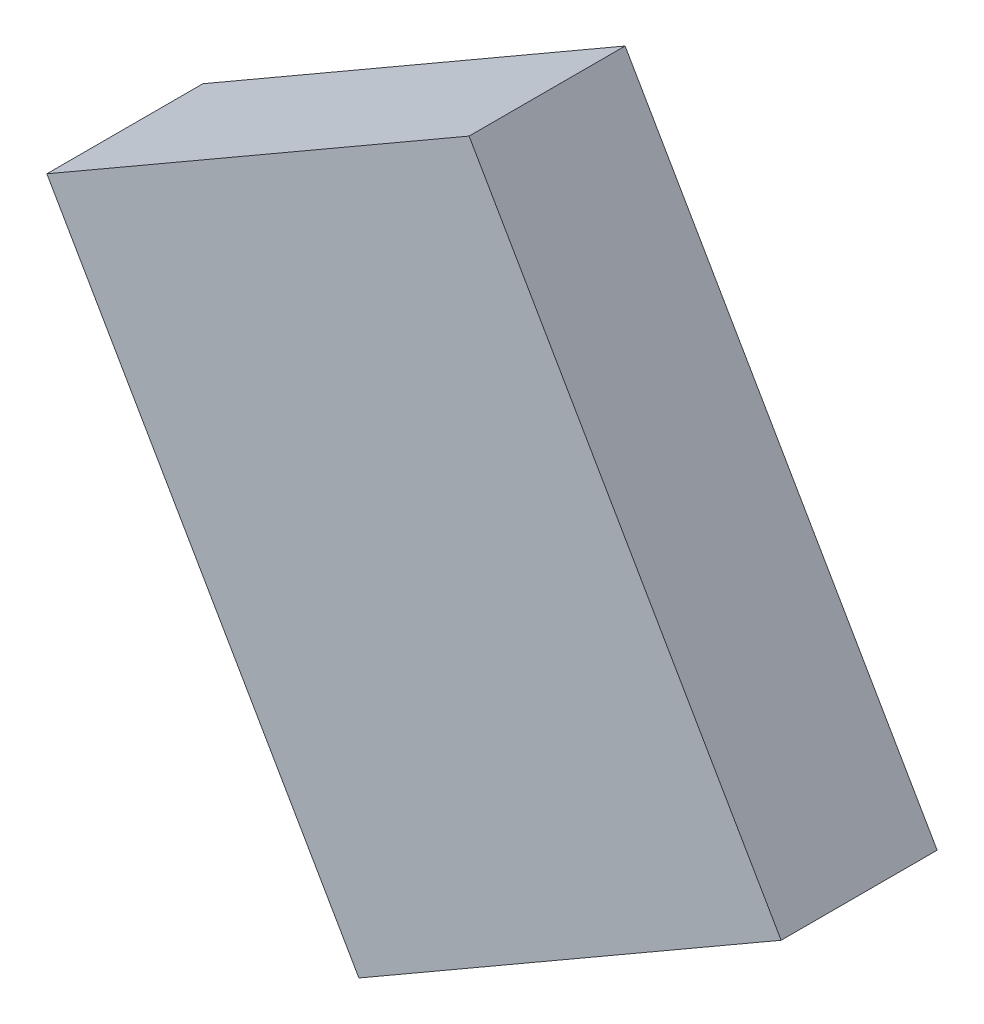
ISO-10303-21;
HEADER;
FILE_DESCRIPTION(('STEP AP214'),'2;1');
FILE_NAME('part.step','',(''),(''),'','','');
FILE_SCHEMA(('AUTOMOTIVE_DESIGN { 1 0 10303 214 1 1 1 1 }'));
ENDSEC;
DATA;
#1=APPLICATION_CONTEXT('core data for automotive mechanical design processes');
#2=APPLICATION_PROTOCOL_DEFINITION('international standard','automotive_design',2000,#1);
#3=PRODUCT_CONTEXT('',#1,'mechanical');
#4=PRODUCT('Part','Part','',(#3));
#5=PRODUCT_RELATED_PRODUCT_CATEGORY('part','',(#4));
#6=PRODUCT_DEFINITION_FORMATION('','',#4);
#7=PRODUCT_DEFINITION_CONTEXT('part definition',#1,'design');
#8=PRODUCT_DEFINITION('design','',#6,#7);
#9=PRODUCT_DEFINITION_SHAPE('','',#8);
#10=(LENGTH_UNIT() NAMED_UNIT(*) SI_UNIT(.MILLI.,.METRE.));
#11=(NAMED_UNIT(*) PLANE_ANGLE_UNIT() SI_UNIT($,.RADIAN.));
#12=(NAMED_UNIT(*) SI_UNIT($,.STERADIAN.) SOLID_ANGLE_UNIT());
#13=UNCERTAINTY_MEASURE_WITH_UNIT(LENGTH_MEASURE(1.E-05),#10,'distance_accuracy_value','');
#14=(GEOMETRIC_REPRESENTATION_CONTEXT(3) GLOBAL_UNCERTAINTY_ASSIGNED_CONTEXT((#13)) GLOBAL_UNIT_ASSIGNED_CONTEXT((#10,
#11,#12)) REPRESENTATION_CONTEXT('',''));
#15=CARTESIAN_POINT('',(0.,0.,0.));
#16=DIRECTION('',(0.,0.,1.));
#17=DIRECTION('',(1.,0.,0.));
#18=AXIS2_PLACEMENT_3D('',#15,#16,#17);
#19=CARTESIAN_POINT('',(-1.88253116,0.7606411,0.80000094));
#20=DIRECTION('',(0.,0.,-1.));
#21=DIRECTION('',(-1.,0.,0.));
#22=AXIS2_PLACEMENT_3D('',#19,#20,#21);
#23=PLANE('',#22);
#24=DIRECTION('',(-0.866024903968885,-0.500000865704934,0.));
#25=VECTOR('',#24,1.);
#26=CARTESIAN_POINT('',(-0.28253182,-2.01064114,0.80000094));
#27=LINE('',#26,#25);
#28=CARTESIAN_POINT('',(-0.282531820000206,-2.01064114000012,0.80000094));
#29=VERTEX_POINT('',#28);
#30=CARTESIAN_POINT('',(1.88253115999996,-0.760638559999925,0.80000094));
#31=VERTEX_POINT('',#30);
#32=EDGE_CURVE('E55',#29,#31,#27,.F.);
#33=ORIENTED_EDGE('',*,*,#32,.T.);
#34=DIRECTION('',(0.500000060750926,-0.866025368709872,0.));
#35=VECTOR('',#34,1.);
#36=CARTESIAN_POINT('',(1.88253116,-0.76063856,0.80000094));
#37=LINE('',#36,#35);
#38=CARTESIAN_POINT('',(0.282531820000269,2.01064114000016,0.80000094));
#39=VERTEX_POINT('',#38);
#40=EDGE_CURVE('E57',#31,#39,#37,.F.);
#41=ORIENTED_EDGE('',*,*,#40,.T.);
#42=DIRECTION('',(0.866025343910241,0.500000103705139,0.));
#43=VECTOR('',#42,1.);
#44=CARTESIAN_POINT('',(0.28253182,2.01064114,0.80000094));
#45=LINE('',#44,#43);
#46=CARTESIAN_POINT('',(-1.88253116000016,0.760641100000285,0.80000094));
#47=VERTEX_POINT('',#46);
#48=EDGE_CURVE('E20',#39,#47,#45,.F.);
#49=ORIENTED_EDGE('',*,*,#48,.T.);
#50=DIRECTION('',(-0.499999717047159,0.866025567147276,0.));
#51=VECTOR('',#50,1.);
#52=CARTESIAN_POINT('',(-1.88253116,0.7606411,0.80000094));
#53=LINE('',#52,#51);
#54=EDGE_CURVE('E80',#47,#29,#53,.F.);
#55=ORIENTED_EDGE('',*,*,#54,.T.);
#56=EDGE_LOOP('',(#33,#41,#49,#55));
#57=FACE_BOUND('',#56,.T.);
#58=ADVANCED_FACE('F17',(#57),#23,.F.);
#59=CARTESIAN_POINT('',(0.28253182,2.01064114,0.));
#60=DIRECTION('',(0.500000103705139,-0.866025343910241,0.));
#61=DIRECTION('',(0.866025343910241,0.500000103705139,0.));
#62=AXIS2_PLACEMENT_3D('',#59,#60,#61);
#63=PLANE('',#62);
#64=DIRECTION('',(0.,0.,1.));
#65=VECTOR('',#64,1.);
#66=CARTESIAN_POINT('',(-1.88253116,0.7606411,0.));
#67=LINE('',#66,#65);
#68=CARTESIAN_POINT('',(-1.88253116000016,0.760641100000285,0.));
#69=VERTEX_POINT('',#68);
#70=EDGE_CURVE('E68',#69,#47,#67,.T.);
#71=ORIENTED_EDGE('',*,*,#70,.T.);
#72=ORIENTED_EDGE('',*,*,#48,.F.);
#73=DIRECTION('',(0.,0.,1.));
#74=VECTOR('',#73,1.);
#75=CARTESIAN_POINT('',(0.282531820001077,2.01064114000062,0.));
#76=LINE('',#75,#74);
#77=CARTESIAN_POINT('',(0.282531820000269,2.01064114000016,0.));
#78=VERTEX_POINT('',#77);
#79=EDGE_CURVE('E63',#39,#78,#76,.F.);
#80=ORIENTED_EDGE('',*,*,#79,.T.);
#81=DIRECTION('',(0.866025343910109,0.500000103705367,0.));
#82=VECTOR('',#81,1.);
#83=CARTESIAN_POINT('',(-1.88253116,0.7606411,0.));
#84=LINE('',#83,#82);
#85=EDGE_CURVE('E83',#69,#78,#84,.T.);
#86=ORIENTED_EDGE('',*,*,#85,.F.);
#87=EDGE_LOOP('',(#71,#72,#80,#86));
#88=FACE_BOUND('',#87,.T.);
#89=ADVANCED_FACE('F65',(#88),#63,.F.);
#90=CARTESIAN_POINT('',(1.88253116,-0.76063856,0.));
#91=DIRECTION('',(-0.866025368709872,-0.500000060750926,0.));
#92=DIRECTION('',(0.500000060750926,-0.866025368709872,0.));
#93=AXIS2_PLACEMENT_3D('',#90,#91,#92);
#94=PLANE('',#93);
#95=ORIENTED_EDGE('',*,*,#79,.F.);
#96=ORIENTED_EDGE('',*,*,#40,.F.);
#97=DIRECTION('',(0.,0.,1.));
#98=VECTOR('',#97,1.);
#99=CARTESIAN_POINT('',(1.88253115999983,-0.760638559999701,0.));
#100=LINE('',#99,#98);
#101=CARTESIAN_POINT('',(1.88253115999996,-0.760638559999925,0.));
#102=VERTEX_POINT('',#101);
#103=EDGE_CURVE('E75',#31,#102,#100,.F.);
#104=ORIENTED_EDGE('',*,*,#103,.T.);
#105=DIRECTION('',(0.500000060751263,-0.866025368709678,0.));
#106=VECTOR('',#105,1.);
#107=CARTESIAN_POINT('',(0.28253182,2.01064114,0.));
#108=LINE('',#107,#106);
#109=EDGE_CURVE('E72',#78,#102,#108,.T.);
#110=ORIENTED_EDGE('',*,*,#109,.F.);
#111=EDGE_LOOP('',(#95,#96,#104,#110));
#112=FACE_BOUND('',#111,.T.);
#113=ADVANCED_FACE('F70',(#112),#94,.F.);
#114=CARTESIAN_POINT('',(-0.28253182,-2.01064114,0.));
#115=DIRECTION('',(-0.500000865704934,0.866024903968885,0.));
#116=DIRECTION('',(-0.866024903968885,-0.500000865704934,0.));
#117=AXIS2_PLACEMENT_3D('',#114,#115,#116);
#118=PLANE('',#117);
#119=ORIENTED_EDGE('',*,*,#103,.F.);
#120=ORIENTED_EDGE('',*,*,#32,.F.);
#121=DIRECTION('',(0.,0.,1.));
#122=VECTOR('',#121,1.);
#123=CARTESIAN_POINT('',(-0.282531820000822,-2.01064114000048,0.));
#124=LINE('',#123,#122);
#125=CARTESIAN_POINT('',(-0.282531820000206,-2.01064114000012,0.));
#126=VERTEX_POINT('',#125);
#127=EDGE_CURVE('E35',#29,#126,#124,.F.);
#128=ORIENTED_EDGE('',*,*,#127,.T.);
#129=DIRECTION('',(-0.866024903968954,-0.500000865704814,0.));
#130=VECTOR('',#129,1.);
#131=CARTESIAN_POINT('',(1.88253116,-0.76063856,0.));
#132=LINE('',#131,#130);
#133=EDGE_CURVE('E26',#102,#126,#132,.T.);
#134=ORIENTED_EDGE('',*,*,#133,.F.);
#135=EDGE_LOOP('',(#119,#120,#128,#134));
#136=FACE_BOUND('',#135,.T.);
#137=ADVANCED_FACE('F89',(#136),#118,.F.);
#138=CARTESIAN_POINT('',(-1.88253116,0.7606411,0.));
#139=DIRECTION('',(0.866025567147276,0.499999717047159,0.));
#140=DIRECTION('',(-0.499999717047159,0.866025567147276,0.));
#141=AXIS2_PLACEMENT_3D('',#138,#139,#140);
#142=PLANE('',#141);
#143=ORIENTED_EDGE('',*,*,#127,.F.);
#144=ORIENTED_EDGE('',*,*,#54,.F.);
#145=ORIENTED_EDGE('',*,*,#70,.F.);
#146=DIRECTION('',(-0.499999717047416,0.866025567147127,0.));
#147=VECTOR('',#146,1.);
#148=CARTESIAN_POINT('',(-0.28253182,-2.01064114,0.));
#149=LINE('',#148,#147);
#150=EDGE_CURVE('E11',#126,#69,#149,.T.);
#151=ORIENTED_EDGE('',*,*,#150,.F.);
#152=EDGE_LOOP('',(#143,#144,#145,#151));
#153=FACE_BOUND('',#152,.T.);
#154=ADVANCED_FACE('F91',(#153),#142,.F.);
#155=CARTESIAN_POINT('',(-1.88253116,0.7606411,0.));
#156=DIRECTION('',(0.,0.,-1.));
#157=DIRECTION('',(-1.,0.,0.));
#158=AXIS2_PLACEMENT_3D('',#155,#156,#157);
#159=PLANE('',#158);
#160=ORIENTED_EDGE('',*,*,#133,.T.);
#161=ORIENTED_EDGE('',*,*,#150,.T.);
#162=ORIENTED_EDGE('',*,*,#85,.T.);
#163=ORIENTED_EDGE('',*,*,#109,.T.);
#164=EDGE_LOOP('',(#160,#161,#162,#163));
#165=FACE_BOUND('',#164,.T.);
#166=ADVANCED_FACE('F88',(#165),#159,.T.);
#167=CLOSED_SHELL('',(#58,#89,#113,#137,#154,#166));
#168=MANIFOLD_SOLID_BREP('B1',#167);
#169=ADVANCED_BREP_SHAPE_REPRESENTATION('',(#18,#168),#14);
#170=SHAPE_DEFINITION_REPRESENTATION(#9,#169);
ENDSEC;
END-ISO-10303-21;
